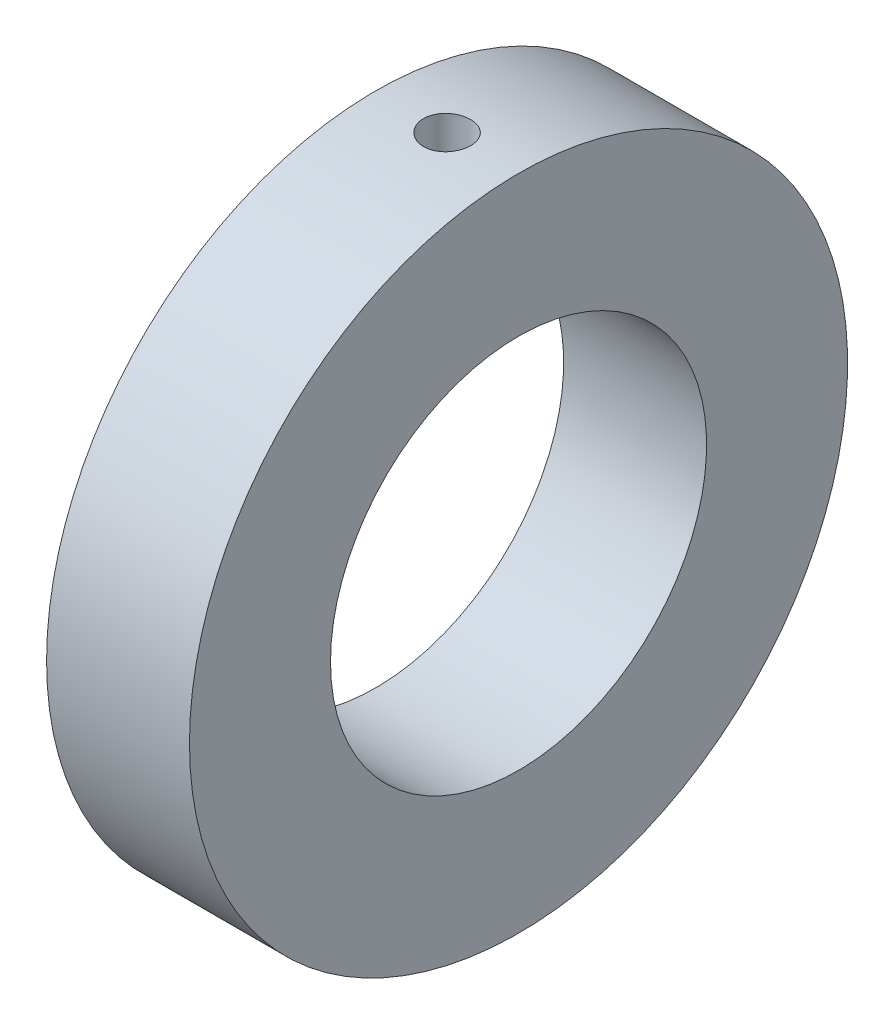
ISO-10303-21;
HEADER;
FILE_DESCRIPTION(('STEP AP214'),'2;1');
FILE_NAME('part.step','',(''),(''),'','','');
FILE_SCHEMA(('AUTOMOTIVE_DESIGN { 1 0 10303 214 1 1 1 1 }'));
ENDSEC;
DATA;
#1=APPLICATION_CONTEXT('core data for automotive mechanical design processes');
#2=APPLICATION_PROTOCOL_DEFINITION('international standard','automotive_design',2000,#1);
#3=PRODUCT_CONTEXT('',#1,'mechanical');
#4=PRODUCT('Part','Part','',(#3));
#5=PRODUCT_RELATED_PRODUCT_CATEGORY('part','',(#4));
#6=PRODUCT_DEFINITION_FORMATION('','',#4);
#7=PRODUCT_DEFINITION_CONTEXT('part definition',#1,'design');
#8=PRODUCT_DEFINITION('design','',#6,#7);
#9=PRODUCT_DEFINITION_SHAPE('','',#8);
#10=(LENGTH_UNIT() NAMED_UNIT(*) SI_UNIT(.MILLI.,.METRE.));
#11=(NAMED_UNIT(*) PLANE_ANGLE_UNIT() SI_UNIT($,.RADIAN.));
#12=(NAMED_UNIT(*) SI_UNIT($,.STERADIAN.) SOLID_ANGLE_UNIT());
#13=UNCERTAINTY_MEASURE_WITH_UNIT(LENGTH_MEASURE(1.E-05),#10,'distance_accuracy_value','');
#14=(GEOMETRIC_REPRESENTATION_CONTEXT(3) GLOBAL_UNCERTAINTY_ASSIGNED_CONTEXT((#13)) GLOBAL_UNIT_ASSIGNED_CONTEXT((#10,
#11,#12)) REPRESENTATION_CONTEXT('',''));
#15=CARTESIAN_POINT('',(0.,0.,0.));
#16=DIRECTION('',(0.,0.,1.));
#17=DIRECTION('',(1.,0.,0.));
#18=AXIS2_PLACEMENT_3D('',#15,#16,#17);
#19=CARTESIAN_POINT('',(-2.413,0.,-2.38125));
#20=DIRECTION('',(-1.,0.,0.));
#21=DIRECTION('',(0.,0.,1.));
#22=AXIS2_PLACEMENT_3D('',#19,#20,#21);
#23=PLANE('',#22);
#24=CARTESIAN_POINT('',(-2.413,0.,-8.73125));
#25=DIRECTION('',(-1.,0.,0.));
#26=DIRECTION('',(0.,0.,1.));
#27=AXIS2_PLACEMENT_3D('',#24,#25,#26);
#28=CIRCLE('',#27,11.1125);
#29=CARTESIAN_POINT('',(-2.413,0.,2.38125));
#30=VERTEX_POINT('',#29);
#31=EDGE_CURVE('E71',#30,#30,#28,.T.);
#32=ORIENTED_EDGE('',*,*,#31,.T.);
#33=EDGE_LOOP('',(#32));
#34=FACE_BOUND('',#33,.T.);
#35=CARTESIAN_POINT('',(-2.413,0.,-8.73125));
#36=DIRECTION('',(-1.,0.,0.));
#37=DIRECTION('',(0.,0.,1.));
#38=AXIS2_PLACEMENT_3D('',#35,#36,#37);
#39=CIRCLE('',#38,6.35);
#40=CARTESIAN_POINT('',(-2.413,0.,-2.38125));
#41=VERTEX_POINT('',#40);
#42=EDGE_CURVE('E55',#41,#41,#39,.T.);
#43=ORIENTED_EDGE('',*,*,#42,.F.);
#44=EDGE_LOOP('',(#43));
#45=FACE_BOUND('',#44,.T.);
#46=ADVANCED_FACE('F43',(#34,#45),#23,.T.);
#47=CARTESIAN_POINT('',(-13.5111981981982,0.,-8.73125));
#48=DIRECTION('',(-1.,0.,0.));
#49=DIRECTION('',(0.,0.,1.));
#50=AXIS2_PLACEMENT_3D('',#47,#48,#49);
#51=CYLINDRICAL_SURFACE('',#50,6.35);
#52=CARTESIAN_POINT('',(0.,6.30019530947256,-7.93750000000001));
#53=CARTESIAN_POINT('',(-0.0443980201039061,6.30019594724397,-7.93750188759023));
#54=CARTESIAN_POINT('',(-0.0888237888572788,6.30066969200265,-7.94123764206075));
#55=CARTESIAN_POINT('',(-0.176438949065962,6.30251276636141,-7.95608123864348));
#56=CARTESIAN_POINT('',(-0.21962699930781,6.3038830317914,-7.96719678430352));
#57=CARTESIAN_POINT('',(-0.303485512571838,6.30736157173698,-7.99646715002776));
#58=CARTESIAN_POINT('',(-0.344157662622672,6.30946934526534,-8.01461719247656));
#59=CARTESIAN_POINT('',(-0.421871283453825,6.31418480467571,-8.05743111699863));
#60=CARTESIAN_POINT('',(-0.458913373428417,6.3167924050751,-8.08209388550851));
#61=CARTESIAN_POINT('',(-0.528530263461272,6.32223005059938,-8.13738102954105));
#62=CARTESIAN_POINT('',(-0.561081809736242,6.32506114240399,-8.16803458622979));
#63=CARTESIAN_POINT('',(-0.620592729138151,6.33061736438077,-8.23437035473689));
#64=CARTESIAN_POINT('',(-0.647551824050059,6.33334248927579,-8.27005281658658));
#65=CARTESIAN_POINT('',(-0.695195961493265,6.33839043664571,-8.34557962876038));
#66=CARTESIAN_POINT('',(-0.715859961819136,6.34071189896361,-8.38543735165935));
#67=CARTESIAN_POINT('',(-0.75019255598125,6.34467945233062,-8.46809116701725));
#68=CARTESIAN_POINT('',(-0.763861409449162,6.34632556844542,-8.51088715035291));
#69=CARTESIAN_POINT('',(-0.783746231696173,6.34874958564227,-8.59796486913902));
#70=CARTESIAN_POINT('',(-0.790000857931329,6.34953198860411,-8.64223764955688));
#71=CARTESIAN_POINT('',(-0.794999484749095,6.35015579639026,-8.73121088378202));
#72=CARTESIAN_POINT('',(-0.793743780794925,6.34999723823285,-8.77591132069584));
#73=CARTESIAN_POINT('',(-0.78378837312451,6.34876063166978,-8.86420797289942));
#74=CARTESIAN_POINT('',(-0.775130244732156,6.34768771879693,-8.90780895783022));
#75=CARTESIAN_POINT('',(-0.750680751419988,6.34474872761691,-8.99293418703996));
#76=CARTESIAN_POINT('',(-0.734889250892024,6.3428826342311,-9.03445839182184));
#77=CARTESIAN_POINT('',(-0.696577063541142,6.33855811854013,-9.11438004890177));
#78=CARTESIAN_POINT('',(-0.674038384670661,6.33609811595228,-9.15276878733936));
#79=CARTESIAN_POINT('',(-0.622884719996404,6.33086100178227,-9.2252347411073));
#80=CARTESIAN_POINT('',(-0.594269455518722,6.32808387565944,-9.25931175858651));
#81=CARTESIAN_POINT('',(-0.531542047595008,6.32250090438716,-9.3224311997704));
#82=CARTESIAN_POINT('',(-0.497393671343929,6.31969499268001,-9.35143762169872));
#83=CARTESIAN_POINT('',(-0.424693855721567,6.31438942841134,-9.40331268007347));
#84=CARTESIAN_POINT('',(-0.386142402549163,6.31188977680982,-9.42618129728064));
#85=CARTESIAN_POINT('',(-0.305698685158959,6.30747977329538,-9.46513365211251));
#86=CARTESIAN_POINT('',(-0.263805009614857,6.30556967200832,-9.48121450523128));
#87=CARTESIAN_POINT('',(-0.17788272350523,6.30255991992466,-9.50610292529361));
#88=CARTESIAN_POINT('',(-0.13385421593698,6.30146023007028,-9.51491084275887));
#89=CARTESIAN_POINT('',(-0.0452300397150751,6.30020294688936,-9.52495568713098));
#90=CARTESIAN_POINT('',(-0.000640199669308886,6.30003904912954,-9.52624327983445));
#91=CARTESIAN_POINT('',(0.0881195626687672,6.30065523305488,-9.5213446076507));
#92=CARTESIAN_POINT('',(0.132289493891181,6.30143529461961,-9.51515850206486));
#93=CARTESIAN_POINT('',(0.218803779935969,6.30384575043666,-9.49553069324077));
#94=CARTESIAN_POINT('',(0.261153787822951,6.30547326880555,-9.48211352358937));
#95=CARTESIAN_POINT('',(0.343002919165873,6.30939292465732,-9.44842970581936));
#96=CARTESIAN_POINT('',(0.382501942398972,6.31168508549068,-9.42816281704953));
#97=CARTESIAN_POINT('',(0.457757099410621,6.31669085704652,-9.38123029203418));
#98=CARTESIAN_POINT('',(0.493492366237325,6.31940662944024,-9.35453143046572));
#99=CARTESIAN_POINT('',(0.559992705874367,6.3249468355745,-9.29553981070214));
#100=CARTESIAN_POINT('',(0.590757585268079,6.32777127353834,-9.26324683492009));
#101=CARTESIAN_POINT('',(0.646621829478668,6.3332299315811,-9.19376233873983));
#102=CARTESIAN_POINT('',(0.671687901857404,6.33586297567225,-9.15654394624715));
#103=CARTESIAN_POINT('',(0.715212634098722,6.34062458387536,-9.07839579468396));
#104=CARTESIAN_POINT('',(0.733671427142702,6.3427531581555,-9.03746611044194));
#105=CARTESIAN_POINT('',(0.763402647343292,6.34626077282387,-8.95316785027677));
#106=CARTESIAN_POINT('',(0.774694315490029,6.34764181855846,-8.90980614736749));
#107=CARTESIAN_POINT('',(0.789833348329487,6.34950709610127,-8.82178387318575));
#108=CARTESIAN_POINT('',(0.793681048715249,6.34999136835031,-8.7771233605766));
#109=CARTESIAN_POINT('',(0.793816650327751,6.35000834394339,-8.68809629428835));
#110=CARTESIAN_POINT('',(0.790155887480322,6.34954750905789,-8.64372981127557));
#111=CARTESIAN_POINT('',(0.775487205235702,6.34773889567646,-8.5562478920888));
#112=CARTESIAN_POINT('',(0.764479290948259,6.34639111779736,-8.51313245504475));
#113=CARTESIAN_POINT('',(0.735444898693964,6.3429593905482,-8.42938324185153));
#114=CARTESIAN_POINT('',(0.717420879298994,6.34087569907944,-8.38874860214934));
#115=CARTESIAN_POINT('',(0.674871232612095,6.33620287114994,-8.31107261545678));
#116=CARTESIAN_POINT('',(0.650345528026906,6.3336137286804,-8.2740313111918));
#117=CARTESIAN_POINT('',(0.595298779130692,6.32819789071371,-8.20433120117189));
#118=CARTESIAN_POINT('',(0.564739538056234,6.32536975106057,-8.17170267236262));
#119=CARTESIAN_POINT('',(0.49857249027083,6.31980625486799,-8.11201669477486));
#120=CARTESIAN_POINT('',(0.462963489396633,6.31707092046522,-8.08496056747557));
#121=CARTESIAN_POINT('',(0.387550049543583,6.31199147617813,-8.03709808550116));
#122=CARTESIAN_POINT('',(0.347729940195604,6.3096489178635,-8.01631626884457));
#123=CARTESIAN_POINT('',(0.26515798486116,6.3056384495298,-7.98176417095099));
#124=CARTESIAN_POINT('',(0.222409385221169,6.30396980616356,-7.96798626388502));
#125=CARTESIAN_POINT('',(0.149532979113677,6.301901248153,-7.95113157794445));
#126=CARTESIAN_POINT('',(0.119864837886819,6.30126470733206,-7.94602708765415));
#127=CARTESIAN_POINT('',(0.0601353731354996,6.30041152357997,-7.93921067225001));
#128=CARTESIAN_POINT('',(0.0300740525959466,6.30019487746296,-7.93749872139597));
#129=CARTESIAN_POINT('',(0.,6.30019530947256,-7.93750000000001));
#130=B_SPLINE_CURVE_WITH_KNOTS('',3,(#52,#53,#54,#55,#56,#57,#58,#59,#60,#61,#62,#63,#64,#65,
#66,#67,#68,#69,#70,#71,#72,#73,#74,#75,#76,#77,#78,#79,#80,#81,#82,#83,#84,#85,#86,#87,#88,#89,
#90,#91,#92,#93,#94,#95,#96,#97,#98,#99,#100,#101,#102,#103,#104,#105,#106,#107,#108,#109,#110,
#111,#112,#113,#114,#115,#116,#117,#118,#119,#120,#121,#122,#123,#124,#125,#126,#127,#128,#129),
.UNSPECIFIED.,.T.,.F.,(4,2,2,2,2,2,2,2,2,2,2,2,2,2,2,2,2,2,2,2,2,2,2,2,2,2,2,2,2,2,2,2,2,2,2,2,
2,2,4),(0.,0.133084194549657,0.266307530678379,0.399440543694528,0.532550807993191,
0.666326383718279,0.800108612957681,0.934333241012718,1.06855288682895,1.20206959528912,
1.33558105111508,1.46834753616239,1.60111654525792,1.73424279901064,1.86737515928939,
2.0014174391744,2.13546013921665,2.26955974439633,2.40365288622088,2.53684156653365,
2.67002740798857,2.8027641947294,2.93550564539761,3.06894807705253,3.20239570020849,
3.33660396270816,3.47080951985066,3.60465324529215,3.73849093477864,3.87141661671517,
4.00434220620552,4.13722125800244,4.27010188956145,4.40385240922836,4.53763461102142,
4.67193343521281,4.80608572049286,4.89623414208457,4.98638187969108),.UNSPECIFIED.);
#131=CARTESIAN_POINT('',(0.,6.30019530947256,-7.93750000000001));
#132=VERTEX_POINT('',#131);
#133=EDGE_CURVE('E75',#132,#132,#130,.T.);
#134=ORIENTED_EDGE('',*,*,#133,.F.);
#135=EDGE_LOOP('',(#134));
#136=FACE_BOUND('',#135,.T.);
#137=ORIENTED_EDGE('',*,*,#42,.T.);
#138=EDGE_LOOP('',(#137));
#139=FACE_BOUND('',#138,.T.);
#140=CARTESIAN_POINT('',(2.413,0.,-8.73125));
#141=DIRECTION('',(-1.,0.,0.));
#142=DIRECTION('',(0.,0.,1.));
#143=AXIS2_PLACEMENT_3D('',#140,#141,#142);
#144=CIRCLE('',#143,6.35);
#145=CARTESIAN_POINT('',(2.413,0.,-2.38125));
#146=VERTEX_POINT('',#145);
#147=EDGE_CURVE('E60',#146,#146,#144,.T.);
#148=ORIENTED_EDGE('',*,*,#147,.F.);
#149=EDGE_LOOP('',(#148));
#150=FACE_BOUND('',#149,.T.);
#151=ADVANCED_FACE('F81',(#136,#139,#150),#51,.F.);
#152=CARTESIAN_POINT('',(2.413,0.,-2.38125));
#153=DIRECTION('',(1.,0.,0.));
#154=DIRECTION('',(0.,0.,-1.));
#155=AXIS2_PLACEMENT_3D('',#152,#153,#154);
#156=PLANE('',#155);
#157=ORIENTED_EDGE('',*,*,#147,.T.);
#158=EDGE_LOOP('',(#157));
#159=FACE_BOUND('',#158,.T.);
#160=CARTESIAN_POINT('',(2.413,0.,-8.73125));
#161=DIRECTION('',(-1.,0.,0.));
#162=DIRECTION('',(0.,0.,1.));
#163=AXIS2_PLACEMENT_3D('',#160,#161,#162);
#164=CIRCLE('',#163,11.1125);
#165=CARTESIAN_POINT('',(2.413,0.,2.38125));
#166=VERTEX_POINT('',#165);
#167=EDGE_CURVE('E65',#166,#166,#164,.T.);
#168=ORIENTED_EDGE('',*,*,#167,.F.);
#169=EDGE_LOOP('',(#168));
#170=FACE_BOUND('',#169,.T.);
#171=ADVANCED_FACE('F92',(#159,#170),#156,.T.);
#172=CARTESIAN_POINT('',(-13.5111981981982,0.,-8.73125));
#173=DIRECTION('',(-1.,0.,0.));
#174=DIRECTION('',(0.,0.,1.));
#175=AXIS2_PLACEMENT_3D('',#172,#173,#174);
#176=CYLINDRICAL_SURFACE('',#175,11.1125);
#177=CARTESIAN_POINT('',(0.,11.0841155347416,-7.93750000000001));
#178=CARTESIAN_POINT('',(0.0445242265410667,11.0841159130625,-7.93750195382488));
#179=CARTESIAN_POINT('',(0.0890792890133796,11.0843866977235,-7.94125887529988));
#180=CARTESIAN_POINT('',(0.176958153171145,11.0854406511148,-7.95619149710785));
#181=CARTESIAN_POINT('',(0.220280476675482,11.0862244099976,-7.96737574244063));
#182=CARTESIAN_POINT('',(0.304408267658738,11.088215087502,-7.99683924693605));
#183=CARTESIAN_POINT('',(0.345215088435586,11.0894217762167,-8.01511465188142));
#184=CARTESIAN_POINT('',(0.42317163603061,11.0921220589103,-8.05823521526712));
#185=CARTESIAN_POINT('',(0.460322175810309,11.0936155888923,-8.08307890872183));
#186=CARTESIAN_POINT('',(0.52999328327265,11.0967245042109,-8.13868278412436));
#187=CARTESIAN_POINT('',(0.56250587417714,11.0983400923475,-8.16945295041668));
#188=CARTESIAN_POINT('',(0.621909780755006,11.1015092133407,-8.23601544818307));
#189=CARTESIAN_POINT('',(0.648800857632016,11.1030627435587,-8.27180799289492));
#190=CARTESIAN_POINT('',(0.696223860945102,11.105934537689,-8.34744544855227));
#191=CARTESIAN_POINT('',(0.71674904749429,11.1072525516271,-8.38729459555869));
#192=CARTESIAN_POINT('',(0.750814506108564,11.109502646518,-8.46988444318346));
#193=CARTESIAN_POINT('',(0.76435487160347,11.1104347326329,-8.51262510511591));
#194=CARTESIAN_POINT('',(0.784043809705624,11.1118065411324,-8.59970667866881));
#195=CARTESIAN_POINT('',(0.790205070633804,11.1122471085902,-8.6440447079676));
#196=CARTESIAN_POINT('',(0.795000104086166,11.1125890931904,-8.73312766437079));
#197=CARTESIAN_POINT('',(0.793633983188388,11.1124905179662,-8.77787258570518));
#198=CARTESIAN_POINT('',(0.783423461202867,11.1117660259691,-8.86641320452738));
#199=CARTESIAN_POINT('',(0.774592706615142,11.1111410715058,-8.9102104846993));
#200=CARTESIAN_POINT('',(0.749724783779753,11.1094352612939,-8.99569952700179));
#201=CARTESIAN_POINT('',(0.733687562583562,11.1083544021954,-9.03739127365973));
#202=CARTESIAN_POINT('',(0.694846587103644,11.1058567827618,-9.11752943289595));
#203=CARTESIAN_POINT('',(0.672036677093711,11.1044397170835,-9.15597285204512));
#204=CARTESIAN_POINT('',(0.620302287167792,11.1014290736111,-9.22849040723007));
#205=CARTESIAN_POINT('',(0.591377716684329,11.0998354932029,-9.26256447853713));
#206=CARTESIAN_POINT('',(0.528158058391823,11.0966468656626,-9.32545580473157));
#207=CARTESIAN_POINT('',(0.493851120747566,11.0950518232032,-9.35426114949415));
#208=CARTESIAN_POINT('',(0.420882004588048,11.0920436478699,-9.40570544329879));
#209=CARTESIAN_POINT('',(0.382219823709326,11.0906305150948,-9.42834438899449));
#210=CARTESIAN_POINT('',(0.30162981521084,11.0881458054995,-9.46681255576059));
#211=CARTESIAN_POINT('',(0.25970172537893,11.0870742561395,-9.48264122938333));
#212=CARTESIAN_POINT('',(0.173773757224039,11.0853944775631,-9.50703107785126));
#213=CARTESIAN_POINT('',(0.129773910803162,11.0847862412148,-9.51559236456527));
#214=CARTESIAN_POINT('',(0.0410554422426943,11.0841030274471,-9.52518948344999));
#215=CARTESIAN_POINT('',(-0.0036613780661288,11.0840268754043,-9.52624189224341));
#216=CARTESIAN_POINT('',(-0.0926358657380983,11.0844133474107,-9.52083473601915));
#217=CARTESIAN_POINT('',(-0.136893536231554,11.0848759677843,-9.51437522224892));
#218=CARTESIAN_POINT('',(-0.223646256249257,11.0862867823369,-9.49414137213619));
#219=CARTESIAN_POINT('',(-0.266143104694955,11.0872344670383,-9.48037471015225));
#220=CARTESIAN_POINT('',(-0.348223455698642,11.0895081933038,-9.44592513254194));
#221=CARTESIAN_POINT('',(-0.387806923775157,11.0908342393451,-9.42524213507296));
#222=CARTESIAN_POINT('',(-0.463012916248699,11.0937181144502,-9.37750480332598));
#223=CARTESIAN_POINT('',(-0.498628389853052,11.0952763449577,-9.35043938575104));
#224=CARTESIAN_POINT('',(-0.564816281885587,11.0984476174897,-9.29072158337953));
#225=CARTESIAN_POINT('',(-0.595388636261499,11.1000606602099,-9.25806912763315));
#226=CARTESIAN_POINT('',(-0.650678678492917,11.103163260924,-9.18803267365038));
#227=CARTESIAN_POINT('',(-0.675385622394712,11.1046525891103,-9.15064018206706));
#228=CARTESIAN_POINT('',(-0.718169908359507,11.1073366457151,-9.07222764517509));
#229=CARTESIAN_POINT('',(-0.736247301400185,11.108531376399,-9.03120762776318));
#230=CARTESIAN_POINT('',(-0.765240738618874,11.1104905437234,-8.94674355081583));
#231=CARTESIAN_POINT('',(-0.776163520976716,11.1112553851351,-8.9033018140163));
#232=CARTESIAN_POINT('',(-0.790559719338882,11.1122702231444,-8.81519533100026));
#233=CARTESIAN_POINT('',(-0.794033235256008,11.1125202266473,-8.77053060119522));
#234=CARTESIAN_POINT('',(-0.793431263222878,11.1124772375491,-8.68135215989639));
#235=CARTESIAN_POINT('',(-0.789372560924408,11.1121854523309,-8.63683833354523));
#236=CARTESIAN_POINT('',(-0.773856247330036,11.111094077411,-8.54912605745764));
#237=CARTESIAN_POINT('',(-0.762398624037446,11.110294486886,-8.5059276098541));
#238=CARTESIAN_POINT('',(-0.73241370376156,11.1082773089173,-8.42207042133864));
#239=CARTESIAN_POINT('',(-0.713886576218274,11.107059731492,-8.38141161958434));
#240=CARTESIAN_POINT('',(-0.670290679079889,11.1043430928458,-8.30377919102228));
#241=CARTESIAN_POINT('',(-0.645222052931558,11.1028440377976,-8.26680548342965));
#242=CARTESIAN_POINT('',(-0.589192129621874,11.0997289466528,-8.19750721699055));
#243=CARTESIAN_POINT('',(-0.55821854024634,11.0981126709682,-8.16519260778717));
#244=CARTESIAN_POINT('',(-0.491277474416378,11.0949472946214,-8.10620942597408));
#245=CARTESIAN_POINT('',(-0.455308782852746,11.0933982104248,-8.07954223115261));
#246=CARTESIAN_POINT('',(-0.379346276778986,11.090540074254,-8.03258478767508));
#247=CARTESIAN_POINT('',(-0.339346559604947,11.0892313824356,-8.01230407529497));
#248=CARTESIAN_POINT('',(-0.256528738059491,11.0870067142935,-7.97877182291176));
#249=CARTESIAN_POINT('',(-0.213713976338186,11.0860902815713,-7.96551210960168));
#250=CARTESIAN_POINT('',(-0.142200723473238,11.0849923109585,-7.94981742289333));
#251=CARTESIAN_POINT('',(-0.113963625264314,11.0846650056297,-7.94520442761866));
#252=CARTESIAN_POINT('',(-0.0571552539357825,11.0842264962857,-7.93904509188679));
#253=CARTESIAN_POINT('',(-0.0285839814439525,11.0841152918644,-7.93749874566954));
#254=CARTESIAN_POINT('',(0.,11.0841155347416,-7.93750000000001));
#255=B_SPLINE_CURVE_WITH_KNOTS('',3,(#177,#178,#179,#180,#181,#182,#183,#184,#185,#186,#187,
#188,#189,#190,#191,#192,#193,#194,#195,#196,#197,#198,#199,#200,#201,#202,#203,#204,#205,#206,
#207,#208,#209,#210,#211,#212,#213,#214,#215,#216,#217,#218,#219,#220,#221,#222,#223,#224,#225,
#226,#227,#228,#229,#230,#231,#232,#233,#234,#235,#236,#237,#238,#239,#240,#241,#242,#243,#244,
#245,#246,#247,#248,#249,#250,#251,#252,#253,#254),.UNSPECIFIED.,.T.,.F.,(4,2,2,2,2,2,2,2,2,2,2,
2,2,2,2,2,2,2,2,2,2,2,2,2,2,2,2,2,2,2,2,2,2,2,2,2,2,2,4),(0.,0.133468324103185,
0.267090467700204,0.400640085925448,0.53415994244625,0.667906739506481,0.801659216844632,
0.935552824992747,1.06944464211716,1.20310590109418,1.33676526760465,1.47018081135474,
1.60359733537334,1.73713549539687,1.87067563346346,2.00451400987699,2.13835245892094,
2.272201664637,2.40604880993936,2.53960038217604,2.67315104330954,2.80656171911272,
2.93997397365149,3.07361963184251,3.20726698732612,3.34115729409011,3.47504657128807,
3.60880957017423,3.74257077496163,3.87603424895614,4.00949793935023,4.14295843112278,
4.27641599652195,4.41015447214112,4.54392553817305,4.67789541385823,4.81170898732207,
4.89739409769242,4.98307904712106),.UNSPECIFIED.);
#256=CARTESIAN_POINT('',(0.,11.0841155347416,-7.93750000000001));
#257=VERTEX_POINT('',#256);
#258=EDGE_CURVE('E10',#257,#257,#255,.T.);
#259=ORIENTED_EDGE('',*,*,#258,.F.);
#260=EDGE_LOOP('',(#259));
#261=FACE_BOUND('',#260,.T.);
#262=ORIENTED_EDGE('',*,*,#167,.T.);
#263=EDGE_LOOP('',(#262));
#264=FACE_BOUND('',#263,.T.);
#265=ORIENTED_EDGE('',*,*,#31,.F.);
#266=EDGE_LOOP('',(#265));
#267=FACE_BOUND('',#266,.T.);
#268=ADVANCED_FACE('F87',(#261,#264,#267),#176,.T.);
#269=CARTESIAN_POINT('',(0.,11.1125,-8.73125));
#270=DIRECTION('',(0.,1.,0.));
#271=DIRECTION('',(0.,0.,1.));
#272=AXIS2_PLACEMENT_3D('',#269,#270,#271);
#273=CYLINDRICAL_SURFACE('',#272,0.793749999999992);
#274=ORIENTED_EDGE('',*,*,#133,.T.);
#275=EDGE_LOOP('',(#274));
#276=FACE_BOUND('',#275,.T.);
#277=ORIENTED_EDGE('',*,*,#258,.T.);
#278=EDGE_LOOP('',(#277));
#279=FACE_BOUND('',#278,.T.);
#280=ADVANCED_FACE('F84',(#276,#279),#273,.F.);
#281=CLOSED_SHELL('',(#46,#151,#171,#268,#280));
#282=MANIFOLD_SOLID_BREP('B2',#281);
#283=ADVANCED_BREP_SHAPE_REPRESENTATION('',(#18,#282),#14);
#284=SHAPE_DEFINITION_REPRESENTATION(#9,#283);
ENDSEC;
END-ISO-10303-21;
